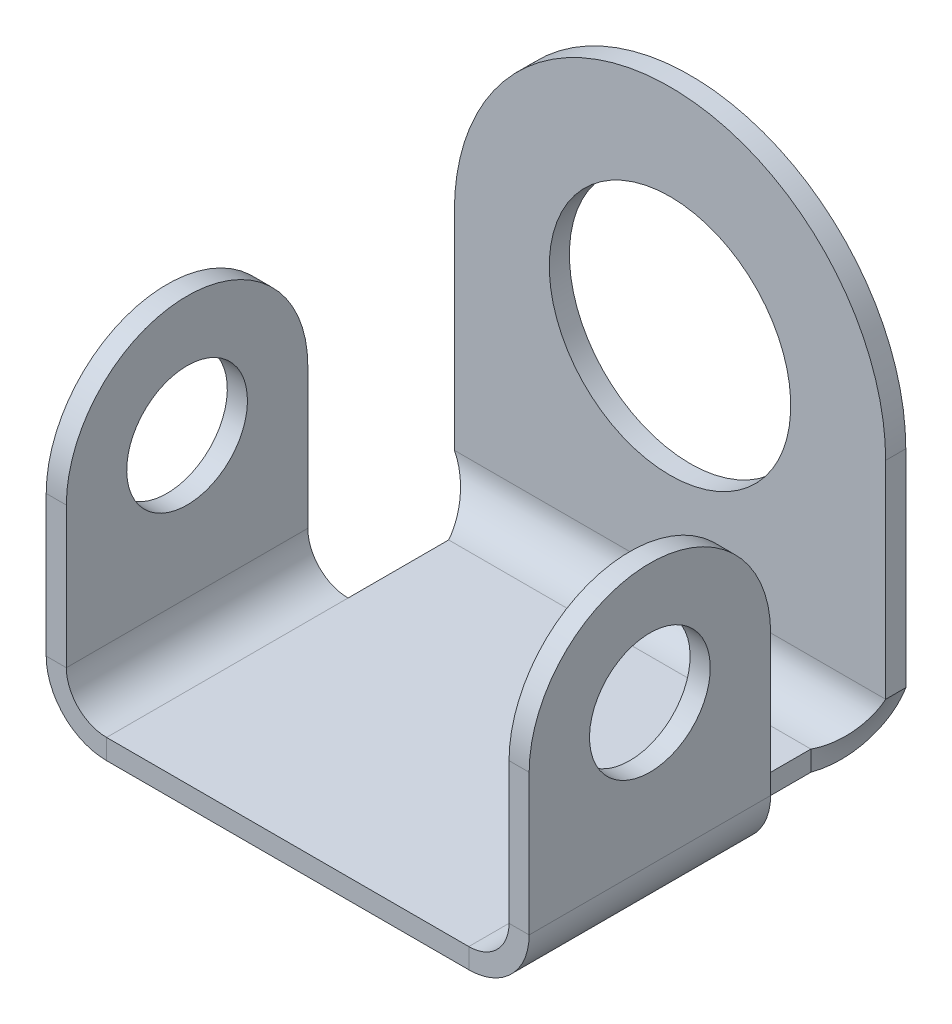
ISO-10303-21;
HEADER;
FILE_DESCRIPTION(('STEP AP214'),'2;1');
FILE_NAME('part.step','',(''),(''),'','','');
FILE_SCHEMA(('AUTOMOTIVE_DESIGN { 1 0 10303 214 1 1 1 1 }'));
ENDSEC;
DATA;
#1=APPLICATION_CONTEXT('core data for automotive mechanical design processes');
#2=APPLICATION_PROTOCOL_DEFINITION('international standard','automotive_design',2000,#1);
#3=PRODUCT_CONTEXT('',#1,'mechanical');
#4=PRODUCT('Part','Part','',(#3));
#5=PRODUCT_RELATED_PRODUCT_CATEGORY('part','',(#4));
#6=PRODUCT_DEFINITION_FORMATION('','',#4);
#7=PRODUCT_DEFINITION_CONTEXT('part definition',#1,'design');
#8=PRODUCT_DEFINITION('design','',#6,#7);
#9=PRODUCT_DEFINITION_SHAPE('','',#8);
#10=(LENGTH_UNIT() NAMED_UNIT(*) SI_UNIT(.MILLI.,.METRE.));
#11=(NAMED_UNIT(*) PLANE_ANGLE_UNIT() SI_UNIT($,.RADIAN.));
#12=(NAMED_UNIT(*) SI_UNIT($,.STERADIAN.) SOLID_ANGLE_UNIT());
#13=UNCERTAINTY_MEASURE_WITH_UNIT(LENGTH_MEASURE(1.E-05),#10,'distance_accuracy_value','');
#14=(GEOMETRIC_REPRESENTATION_CONTEXT(3) GLOBAL_UNCERTAINTY_ASSIGNED_CONTEXT((#13)) GLOBAL_UNIT_ASSIGNED_CONTEXT((#10,
#11,#12)) REPRESENTATION_CONTEXT('',''));
#15=CARTESIAN_POINT('',(0.,0.,0.));
#16=DIRECTION('',(0.,0.,1.));
#17=DIRECTION('',(1.,0.,0.));
#18=AXIS2_PLACEMENT_3D('',#15,#16,#17);
#19=CARTESIAN_POINT('',(0.,-2.5,0.));
#20=DIRECTION('',(0.,-1.,0.));
#21=DIRECTION('',(0.,0.,-1.));
#22=AXIS2_PLACEMENT_3D('',#19,#20,#21);
#23=PLANE('',#22);
#24=DIRECTION('',(0.,0.,-1.));
#25=VECTOR('',#24,1.);
#26=CARTESIAN_POINT('',(-22.5,-2.5,25.));
#27=LINE('',#26,#25);
#28=CARTESIAN_POINT('',(-22.5,-2.5,25.));
#29=VERTEX_POINT('',#28);
#30=CARTESIAN_POINT('',(-22.5,-2.5,-5.));
#31=VERTEX_POINT('',#30);
#32=EDGE_CURVE('E875',#29,#31,#27,.T.);
#33=ORIENTED_EDGE('',*,*,#32,.T.);
#34=DIRECTION('',(0.,0.,-1.));
#35=VECTOR('',#34,1.);
#36=CARTESIAN_POINT('',(-22.5,-2.5,3.74999999999999));
#37=LINE('',#36,#35);
#38=CARTESIAN_POINT('',(-22.5,-2.50000000000005,-17.5));
#39=VERTEX_POINT('',#38);
#40=EDGE_CURVE('E812',#31,#39,#37,.T.);
#41=ORIENTED_EDGE('',*,*,#40,.T.);
#42=DIRECTION('',(1.,0.,0.));
#43=VECTOR('',#42,1.);
#44=CARTESIAN_POINT('',(-26.7928932188135,-2.50000000000005,-17.5));
#45=LINE('',#44,#43);
#46=CARTESIAN_POINT('',(22.5,-2.50000000000005,-17.5));
#47=VERTEX_POINT('',#46);
#48=EDGE_CURVE('E839',#39,#47,#45,.T.);
#49=ORIENTED_EDGE('',*,*,#48,.T.);
#50=DIRECTION('',(0.,0.,1.));
#51=VECTOR('',#50,1.);
#52=CARTESIAN_POINT('',(22.5,-2.5,-21.7928932188135));
#53=LINE('',#52,#51);
#54=CARTESIAN_POINT('',(22.5,-2.5,-5.));
#55=VERTEX_POINT('',#54);
#56=EDGE_CURVE('E828',#47,#55,#53,.T.);
#57=ORIENTED_EDGE('',*,*,#56,.T.);
#58=DIRECTION('',(0.,0.,1.));
#59=VECTOR('',#58,1.);
#60=CARTESIAN_POINT('',(22.5,-2.5,-21.7928932188135));
#61=LINE('',#60,#59);
#62=CARTESIAN_POINT('',(22.5,-2.5,25.));
#63=VERTEX_POINT('',#62);
#64=EDGE_CURVE('E859',#55,#63,#61,.T.);
#65=ORIENTED_EDGE('',*,*,#64,.T.);
#66=DIRECTION('',(1.,0.,0.));
#67=VECTOR('',#66,1.);
#68=CARTESIAN_POINT('',(-30.,-2.5,25.));
#69=LINE('',#68,#67);
#70=EDGE_CURVE('E822',#29,#63,#69,.T.);
#71=ORIENTED_EDGE('',*,*,#70,.F.);
#72=EDGE_LOOP('',(#33,#41,#49,#57,#65,#71));
#73=FACE_BOUND('',#72,.T.);
#74=ADVANCED_FACE('F376',(#73),#23,.T.);
#75=CARTESIAN_POINT('',(0.,0.,0.));
#76=DIRECTION('',(0.,-1.,0.));
#77=DIRECTION('',(0.,0.,-1.));
#78=AXIS2_PLACEMENT_3D('',#75,#76,#77);
#79=PLANE('',#78);
#80=DIRECTION('',(1.,0.,0.));
#81=VECTOR('',#80,1.);
#82=CARTESIAN_POINT('',(-26.7928932188135,0.,-17.5));
#83=LINE('',#82,#81);
#84=CARTESIAN_POINT('',(-22.5,0.,-17.5));
#85=VERTEX_POINT('',#84);
#86=CARTESIAN_POINT('',(22.5,0.,-17.5));
#87=VERTEX_POINT('',#86);
#88=EDGE_CURVE('E386',#85,#87,#83,.T.);
#89=ORIENTED_EDGE('',*,*,#88,.F.);
#90=DIRECTION('',(0.,0.,-1.));
#91=VECTOR('',#90,1.);
#92=CARTESIAN_POINT('',(-22.5,0.,25.));
#93=LINE('',#92,#91);
#94=CARTESIAN_POINT('',(-22.5,0.,-5.));
#95=VERTEX_POINT('',#94);
#96=EDGE_CURVE('E825',#95,#85,#93,.T.);
#97=ORIENTED_EDGE('',*,*,#96,.F.);
#98=DIRECTION('',(0.,0.,-1.));
#99=VECTOR('',#98,1.);
#100=CARTESIAN_POINT('',(-22.5,0.,25.));
#101=LINE('',#100,#99);
#102=CARTESIAN_POINT('',(-22.5,0.,25.));
#103=VERTEX_POINT('',#102);
#104=EDGE_CURVE('E867',#103,#95,#101,.T.);
#105=ORIENTED_EDGE('',*,*,#104,.F.);
#106=DIRECTION('',(1.,0.,0.));
#107=VECTOR('',#106,1.);
#108=CARTESIAN_POINT('',(-30.,0.,25.));
#109=LINE('',#108,#107);
#110=CARTESIAN_POINT('',(22.5,0.,25.));
#111=VERTEX_POINT('',#110);
#112=EDGE_CURVE('E402',#103,#111,#109,.T.);
#113=ORIENTED_EDGE('',*,*,#112,.T.);
#114=DIRECTION('',(0.,0.,1.));
#115=VECTOR('',#114,1.);
#116=CARTESIAN_POINT('',(22.5,0.,-21.7928932188135));
#117=LINE('',#116,#115);
#118=CARTESIAN_POINT('',(22.5,0.,-5.));
#119=VERTEX_POINT('',#118);
#120=EDGE_CURVE('E852',#119,#111,#117,.T.);
#121=ORIENTED_EDGE('',*,*,#120,.F.);
#122=DIRECTION('',(0.,0.,1.));
#123=VECTOR('',#122,1.);
#124=CARTESIAN_POINT('',(22.5,0.,-21.7928932188135));
#125=LINE('',#124,#123);
#126=EDGE_CURVE('E832',#87,#119,#125,.T.);
#127=ORIENTED_EDGE('',*,*,#126,.F.);
#128=EDGE_LOOP('',(#89,#97,#105,#113,#121,#127));
#129=FACE_BOUND('',#128,.T.);
#130=ADVANCED_FACE('F930',(#129),#79,.F.);
#131=CARTESIAN_POINT('',(-30.,-2.5,25.));
#132=DIRECTION('',(0.,0.,1.));
#133=DIRECTION('',(1.,0.,0.));
#134=AXIS2_PLACEMENT_3D('',#131,#132,#133);
#135=PLANE('',#134);
#136=ORIENTED_EDGE('',*,*,#112,.F.);
#137=DIRECTION('',(0.,-1.,0.));
#138=VECTOR('',#137,1.);
#139=CARTESIAN_POINT('',(-22.5,0.,25.));
#140=LINE('',#139,#138);
#141=EDGE_CURVE('E871',#103,#29,#140,.T.);
#142=ORIENTED_EDGE('',*,*,#141,.T.);
#143=ORIENTED_EDGE('',*,*,#70,.T.);
#144=DIRECTION('',(0.,-1.,0.));
#145=VECTOR('',#144,1.);
#146=CARTESIAN_POINT('',(22.5,0.,25.));
#147=LINE('',#146,#145);
#148=EDGE_CURVE('E843',#111,#63,#147,.T.);
#149=ORIENTED_EDGE('',*,*,#148,.F.);
#150=EDGE_LOOP('',(#136,#142,#143,#149));
#151=FACE_BOUND('',#150,.T.);
#152=ADVANCED_FACE('F378',(#151),#135,.T.);
#153=CARTESIAN_POINT('',(22.5,-2.50627500000005,0.));
#154=DIRECTION('',(1.,0.,0.));
#155=DIRECTION('',(0.,0.,-1.));
#156=AXIS2_PLACEMENT_3D('',#153,#154,#155);
#157=PLANE('',#156);
#158=CARTESIAN_POINT('',(22.5,0.,-17.5));
#159=CARTESIAN_POINT('',(22.5,-2.50000000000005,-17.5));
#160=B_SPLINE_CURVE_WITH_KNOTS('',1,(#158,#159),.UNSPECIFIED.,.F.,.F.,(2,2),(0.,1.),.UNSPECIFIED.);
#161=EDGE_CURVE('E13',#47,#87,#160,.F.);
#162=ORIENTED_EDGE('',*,*,#161,.T.);
#163=ORIENTED_EDGE('',*,*,#126,.T.);
#164=DIRECTION('',(0.,1.,0.));
#165=VECTOR('',#164,1.);
#166=CARTESIAN_POINT('',(22.5,-2.50627500000005,-5.));
#167=LINE('',#166,#165);
#168=EDGE_CURVE('E855',#55,#119,#167,.T.);
#169=ORIENTED_EDGE('',*,*,#168,.F.);
#170=ORIENTED_EDGE('',*,*,#56,.F.);
#171=EDGE_LOOP('',(#162,#163,#169,#170));
#172=FACE_BOUND('',#171,.T.);
#173=ADVANCED_FACE('F937',(#172),#157,.T.);
#174=CARTESIAN_POINT('',(-22.5,-2.50627500000005,0.));
#175=DIRECTION('',(-1.,0.,0.));
#176=DIRECTION('',(0.,0.,1.));
#177=AXIS2_PLACEMENT_3D('',#174,#175,#176);
#178=PLANE('',#177);
#179=DIRECTION('',(0.,1.,0.));
#180=VECTOR('',#179,1.);
#181=CARTESIAN_POINT('',(-22.5,-2.50627500000005,-5.));
#182=LINE('',#181,#180);
#183=EDGE_CURVE('E863',#31,#95,#182,.T.);
#184=ORIENTED_EDGE('',*,*,#183,.T.);
#185=ORIENTED_EDGE('',*,*,#96,.T.);
#186=CARTESIAN_POINT('',(-22.5,-2.50000000000005,-17.5));
#187=CARTESIAN_POINT('',(-22.5,0.,-17.5));
#188=B_SPLINE_CURVE_WITH_KNOTS('',1,(#186,#187),.UNSPECIFIED.,.F.,.F.,(2,2),(0.,1.),.UNSPECIFIED.);
#189=EDGE_CURVE('E674',#39,#85,#188,.T.);
#190=ORIENTED_EDGE('',*,*,#189,.F.);
#191=ORIENTED_EDGE('',*,*,#40,.F.);
#192=EDGE_LOOP('',(#184,#185,#190,#191));
#193=FACE_BOUND('',#192,.T.);
#194=ADVANCED_FACE('F941',(#193),#178,.T.);
#195=CARTESIAN_POINT('',(-22.5,5.,-5.));
#196=DIRECTION('',(0.,0.,-1.));
#197=DIRECTION('',(0.,1.,0.));
#198=AXIS2_PLACEMENT_3D('',#195,#196,#197);
#199=PLANE('',#198);
#200=DIRECTION('',(1.,0.,0.));
#201=VECTOR('',#200,1.);
#202=CARTESIAN_POINT('',(-30.,5.00000000000002,-5.));
#203=LINE('',#202,#201);
#204=CARTESIAN_POINT('',(-30.,5.00000000000002,-5.));
#205=VERTEX_POINT('',#204);
#206=CARTESIAN_POINT('',(-27.5,5.00000000000004,-5.));
#207=VERTEX_POINT('',#206);
#208=EDGE_CURVE('E796',#205,#207,#203,.T.);
#209=ORIENTED_EDGE('',*,*,#208,.T.);
#210=CARTESIAN_POINT('',(-22.5,5.,-5.));
#211=DIRECTION('',(0.,0.,-1.));
#212=DIRECTION('',(0.,1.,0.));
#213=AXIS2_PLACEMENT_3D('',#210,#211,#212);
#214=CIRCLE('',#213,5.);
#215=EDGE_CURVE('E754',#207,#95,#214,.F.);
#216=ORIENTED_EDGE('',*,*,#215,.T.);
#217=ORIENTED_EDGE('',*,*,#183,.F.);
#218=CARTESIAN_POINT('',(-22.5,5.,-5.));
#219=DIRECTION('',(0.,0.,1.));
#220=DIRECTION('',(0.,1.,0.));
#221=AXIS2_PLACEMENT_3D('',#218,#219,#220);
#222=CIRCLE('',#221,7.5);
#223=EDGE_CURVE('E803',#205,#31,#222,.T.);
#224=ORIENTED_EDGE('',*,*,#223,.F.);
#225=EDGE_LOOP('',(#209,#216,#217,#224));
#226=FACE_BOUND('',#225,.T.);
#227=ADVANCED_FACE('F1153',(#226),#199,.T.);
#228=CARTESIAN_POINT('',(-22.5,5.,25.));
#229=DIRECTION('',(0.,0.,1.));
#230=DIRECTION('',(1.,0.,0.));
#231=AXIS2_PLACEMENT_3D('',#228,#229,#230);
#232=PLANE('',#231);
#233=ORIENTED_EDGE('',*,*,#141,.F.);
#234=CARTESIAN_POINT('',(-22.5,5.,25.));
#235=DIRECTION('',(0.,0.,-1.));
#236=DIRECTION('',(0.,1.,0.));
#237=AXIS2_PLACEMENT_3D('',#234,#235,#236);
#238=CIRCLE('',#237,5.);
#239=CARTESIAN_POINT('',(-27.5,5.00000000000004,25.));
#240=VERTEX_POINT('',#239);
#241=EDGE_CURVE('E808',#103,#240,#238,.T.);
#242=ORIENTED_EDGE('',*,*,#241,.T.);
#243=DIRECTION('',(-1.,0.,0.));
#244=VECTOR('',#243,1.);
#245=CARTESIAN_POINT('',(-27.5,5.00000000000003,25.));
#246=LINE('',#245,#244);
#247=CARTESIAN_POINT('',(-30.,5.,25.));
#248=VERTEX_POINT('',#247);
#249=EDGE_CURVE('E788',#240,#248,#246,.T.);
#250=ORIENTED_EDGE('',*,*,#249,.T.);
#251=CARTESIAN_POINT('',(-22.5,5.,25.));
#252=DIRECTION('',(0.,0.,-1.));
#253=DIRECTION('',(-1.,0.,0.));
#254=AXIS2_PLACEMENT_3D('',#251,#252,#253);
#255=CIRCLE('',#254,7.5);
#256=EDGE_CURVE('E807',#29,#248,#255,.T.);
#257=ORIENTED_EDGE('',*,*,#256,.F.);
#258=EDGE_LOOP('',(#233,#242,#250,#257));
#259=FACE_BOUND('',#258,.T.);
#260=ADVANCED_FACE('F1145',(#259),#232,.T.);
#261=CARTESIAN_POINT('',(-22.5,5.,41.6643783371692));
#262=DIRECTION('',(0.,0.,-1.));
#263=DIRECTION('',(0.,1.,0.));
#264=AXIS2_PLACEMENT_3D('',#261,#262,#263);
#265=CYLINDRICAL_SURFACE('',#264,7.5);
#266=ORIENTED_EDGE('',*,*,#256,.T.);
#267=DIRECTION('',(0.,0.,-1.));
#268=VECTOR('',#267,1.);
#269=CARTESIAN_POINT('',(-30.,5.00000000000002,-25.));
#270=LINE('',#269,#268);
#271=EDGE_CURVE('E744',#248,#205,#270,.T.);
#272=ORIENTED_EDGE('',*,*,#271,.T.);
#273=ORIENTED_EDGE('',*,*,#223,.T.);
#274=ORIENTED_EDGE('',*,*,#32,.F.);
#275=EDGE_LOOP('',(#266,#272,#273,#274));
#276=FACE_BOUND('',#275,.T.);
#277=ADVANCED_FACE('F1137',(#276),#265,.T.);
#278=CARTESIAN_POINT('',(-22.5,5.,41.6643783371692));
#279=DIRECTION('',(0.,0.,-1.));
#280=DIRECTION('',(0.,1.,0.));
#281=AXIS2_PLACEMENT_3D('',#278,#279,#280);
#282=CYLINDRICAL_SURFACE('',#281,5.);
#283=ORIENTED_EDGE('',*,*,#241,.F.);
#284=ORIENTED_EDGE('',*,*,#104,.T.);
#285=ORIENTED_EDGE('',*,*,#215,.F.);
#286=DIRECTION('',(0.,0.,1.));
#287=VECTOR('',#286,1.);
#288=CARTESIAN_POINT('',(-27.5,5.00000000000004,-25.));
#289=LINE('',#288,#287);
#290=EDGE_CURVE('E792',#207,#240,#289,.T.);
#291=ORIENTED_EDGE('',*,*,#290,.T.);
#292=EDGE_LOOP('',(#283,#284,#285,#291));
#293=FACE_BOUND('',#292,.T.);
#294=ADVANCED_FACE('F1129',(#293),#282,.F.);
#295=CARTESIAN_POINT('',(-30.006275,22.5000000000001,10.));
#296=DIRECTION('',(1.,0.,0.));
#297=DIRECTION('',(0.,0.,1.));
#298=AXIS2_PLACEMENT_3D('',#295,#296,#297);
#299=CYLINDRICAL_SURFACE('',#298,15.);
#300=DIRECTION('',(1.,0.,0.));
#301=VECTOR('',#300,1.);
#302=CARTESIAN_POINT('',(-30.006275,22.5000000000001,25.));
#303=LINE('',#302,#301);
#304=CARTESIAN_POINT('',(-30.0000000000001,22.5000000000001,25.));
#305=VERTEX_POINT('',#304);
#306=CARTESIAN_POINT('',(-27.5000000000001,22.5000000000001,25.));
#307=VERTEX_POINT('',#306);
#308=EDGE_CURVE('E785',#305,#307,#303,.T.);
#309=ORIENTED_EDGE('',*,*,#308,.T.);
#310=CARTESIAN_POINT('',(-27.5000000000001,22.5000000000001,10.));
#311=DIRECTION('',(1.,0.,0.));
#312=DIRECTION('',(0.,1.,0.));
#313=AXIS2_PLACEMENT_3D('',#310,#311,#312);
#314=CIRCLE('',#313,15.);
#315=CARTESIAN_POINT('',(-27.5000000000002,22.5000000000001,-4.99999999999999));
#316=VERTEX_POINT('',#315);
#317=EDGE_CURVE('E782',#307,#316,#314,.F.);
#318=ORIENTED_EDGE('',*,*,#317,.T.);
#319=DIRECTION('',(1.,0.,0.));
#320=VECTOR('',#319,1.);
#321=CARTESIAN_POINT('',(-30.006275,22.5000000000001,-4.99999999999999));
#322=LINE('',#321,#320);
#323=CARTESIAN_POINT('',(-30.0000000000002,22.5000000000001,-4.99999999999999));
#324=VERTEX_POINT('',#323);
#325=EDGE_CURVE('E755',#324,#316,#322,.T.);
#326=ORIENTED_EDGE('',*,*,#325,.F.);
#327=CARTESIAN_POINT('',(-30.0000000000001,22.5000000000001,10.));
#328=DIRECTION('',(1.,0.,0.));
#329=DIRECTION('',(0.,1.,0.));
#330=AXIS2_PLACEMENT_3D('',#327,#328,#329);
#331=CIRCLE('',#330,15.);
#332=EDGE_CURVE('E774',#305,#324,#331,.F.);
#333=ORIENTED_EDGE('',*,*,#332,.F.);
#334=EDGE_LOOP('',(#309,#318,#326,#333));
#335=FACE_BOUND('',#334,.T.);
#336=ADVANCED_FACE('F1121',(#335),#299,.T.);
#337=CARTESIAN_POINT('',(-30.006275,22.5000000000001,10.));
#338=DIRECTION('',(1.,0.,0.));
#339=DIRECTION('',(0.,0.,1.));
#340=AXIS2_PLACEMENT_3D('',#337,#338,#339);
#341=CYLINDRICAL_SURFACE('',#340,7.5);
#342=CARTESIAN_POINT('',(-27.5000000000001,22.5000000000001,10.));
#343=DIRECTION('',(1.,0.,0.));
#344=DIRECTION('',(0.,1.,0.));
#345=AXIS2_PLACEMENT_3D('',#342,#343,#344);
#346=CIRCLE('',#345,7.5);
#347=CARTESIAN_POINT('',(-27.5000000000001,30.0000000000001,10.));
#348=VERTEX_POINT('',#347);
#349=EDGE_CURVE('E759',#348,#348,#346,.F.);
#350=ORIENTED_EDGE('',*,*,#349,.F.);
#351=EDGE_LOOP('',(#350));
#352=FACE_BOUND('',#351,.T.);
#353=CARTESIAN_POINT('',(-30.0000000000001,22.5000000000001,10.));
#354=DIRECTION('',(1.,0.,0.));
#355=DIRECTION('',(0.,1.,0.));
#356=AXIS2_PLACEMENT_3D('',#353,#354,#355);
#357=CIRCLE('',#356,7.5);
#358=CARTESIAN_POINT('',(-30.0000000000001,30.0000000000001,10.));
#359=VERTEX_POINT('',#358);
#360=EDGE_CURVE('E778',#359,#359,#357,.F.);
#361=ORIENTED_EDGE('',*,*,#360,.T.);
#362=EDGE_LOOP('',(#361));
#363=FACE_BOUND('',#362,.T.);
#364=ADVANCED_FACE('F1113',(#352,#363),#341,.F.);
#365=CARTESIAN_POINT('',(-30.,0.,0.));
#366=DIRECTION('',(1.,0.,0.));
#367=DIRECTION('',(0.,1.,0.));
#368=AXIS2_PLACEMENT_3D('',#365,#366,#367);
#369=PLANE('',#368);
#370=ORIENTED_EDGE('',*,*,#360,.F.);
#371=EDGE_LOOP('',(#370));
#372=FACE_BOUND('',#371,.T.);
#373=ORIENTED_EDGE('',*,*,#332,.T.);
#374=DIRECTION('',(0.,-1.,0.));
#375=VECTOR('',#374,1.);
#376=CARTESIAN_POINT('',(-30.,0.,-5.));
#377=LINE('',#376,#375);
#378=EDGE_CURVE('E771',#324,#205,#377,.T.);
#379=ORIENTED_EDGE('',*,*,#378,.T.);
#380=ORIENTED_EDGE('',*,*,#271,.F.);
#381=DIRECTION('',(0.,1.,0.));
#382=VECTOR('',#381,1.);
#383=CARTESIAN_POINT('',(-30.,0.,25.));
#384=LINE('',#383,#382);
#385=EDGE_CURVE('E767',#248,#305,#384,.T.);
#386=ORIENTED_EDGE('',*,*,#385,.T.);
#387=EDGE_LOOP('',(#373,#379,#380,#386));
#388=FACE_BOUND('',#387,.T.);
#389=ADVANCED_FACE('F1105',(#372,#388),#369,.F.);
#390=CARTESIAN_POINT('',(-30.0000000000002,57.5,25.));
#391=DIRECTION('',(0.,0.,-1.));
#392=DIRECTION('',(-1.,0.,0.));
#393=AXIS2_PLACEMENT_3D('',#390,#391,#392);
#394=PLANE('',#393);
#395=DIRECTION('',(0.,-1.,0.));
#396=VECTOR('',#395,1.);
#397=CARTESIAN_POINT('',(-27.5000000000002,57.5,25.));
#398=LINE('',#397,#396);
#399=EDGE_CURVE('E763',#240,#307,#398,.F.);
#400=ORIENTED_EDGE('',*,*,#399,.T.);
#401=ORIENTED_EDGE('',*,*,#308,.F.);
#402=ORIENTED_EDGE('',*,*,#385,.F.);
#403=ORIENTED_EDGE('',*,*,#249,.F.);
#404=EDGE_LOOP('',(#400,#401,#402,#403));
#405=FACE_BOUND('',#404,.T.);
#406=ADVANCED_FACE('F1097',(#405),#394,.F.);
#407=CARTESIAN_POINT('',(-27.5,0.,0.));
#408=DIRECTION('',(1.,0.,0.));
#409=DIRECTION('',(0.,1.,0.));
#410=AXIS2_PLACEMENT_3D('',#407,#408,#409);
#411=PLANE('',#410);
#412=ORIENTED_EDGE('',*,*,#349,.T.);
#413=EDGE_LOOP('',(#412));
#414=FACE_BOUND('',#413,.T.);
#415=DIRECTION('',(0.,-1.,0.));
#416=VECTOR('',#415,1.);
#417=CARTESIAN_POINT('',(-27.5,0.,-5.));
#418=LINE('',#417,#416);
#419=EDGE_CURVE('E751',#316,#207,#418,.T.);
#420=ORIENTED_EDGE('',*,*,#419,.F.);
#421=ORIENTED_EDGE('',*,*,#317,.F.);
#422=ORIENTED_EDGE('',*,*,#399,.F.);
#423=ORIENTED_EDGE('',*,*,#290,.F.);
#424=EDGE_LOOP('',(#420,#421,#422,#423));
#425=FACE_BOUND('',#424,.T.);
#426=ADVANCED_FACE('F1089',(#414,#425),#411,.T.);
#427=CARTESIAN_POINT('',(-30.0062750000002,-27.3174770424681,-5.));
#428=DIRECTION('',(0.,0.,1.));
#429=DIRECTION('',(0.,-1.,0.));
#430=AXIS2_PLACEMENT_3D('',#427,#428,#429);
#431=PLANE('',#430);
#432=ORIENTED_EDGE('',*,*,#208,.F.);
#433=ORIENTED_EDGE('',*,*,#378,.F.);
#434=ORIENTED_EDGE('',*,*,#325,.T.);
#435=ORIENTED_EDGE('',*,*,#419,.T.);
#436=EDGE_LOOP('',(#432,#433,#434,#435));
#437=FACE_BOUND('',#436,.T.);
#438=ADVANCED_FACE('F1081',(#437),#431,.F.);
#439=CARTESIAN_POINT('',(22.5,5.,-5.));
#440=DIRECTION('',(0.,0.,-1.));
#441=DIRECTION('',(-1.,0.,0.));
#442=AXIS2_PLACEMENT_3D('',#439,#440,#441);
#443=PLANE('',#442);
#444=ORIENTED_EDGE('',*,*,#168,.T.);
#445=CARTESIAN_POINT('',(22.5,5.,-5.));
#446=DIRECTION('',(0.,0.,1.));
#447=DIRECTION('',(1.,0.,0.));
#448=AXIS2_PLACEMENT_3D('',#445,#446,#447);
#449=CIRCLE('',#448,5.);
#450=CARTESIAN_POINT('',(27.5,5.00000000000008,-5.));
#451=VERTEX_POINT('',#450);
#452=EDGE_CURVE('E686',#119,#451,#449,.T.);
#453=ORIENTED_EDGE('',*,*,#452,.T.);
#454=DIRECTION('',(1.,0.,0.));
#455=VECTOR('',#454,1.);
#456=CARTESIAN_POINT('',(27.5,5.00000000000008,-5.));
#457=LINE('',#456,#455);
#458=CARTESIAN_POINT('',(30.,5.00000000000007,-5.));
#459=VERTEX_POINT('',#458);
#460=EDGE_CURVE('E723',#451,#459,#457,.T.);
#461=ORIENTED_EDGE('',*,*,#460,.T.);
#462=CARTESIAN_POINT('',(22.5,5.,-5.));
#463=DIRECTION('',(0.,0.,1.));
#464=DIRECTION('',(1.,0.,0.));
#465=AXIS2_PLACEMENT_3D('',#462,#463,#464);
#466=CIRCLE('',#465,7.5);
#467=EDGE_CURVE('E735',#55,#459,#466,.T.);
#468=ORIENTED_EDGE('',*,*,#467,.F.);
#469=EDGE_LOOP('',(#444,#453,#461,#468));
#470=FACE_BOUND('',#469,.T.);
#471=ADVANCED_FACE('F1073',(#470),#443,.T.);
#472=CARTESIAN_POINT('',(22.5,5.,25.));
#473=DIRECTION('',(0.,0.,1.));
#474=DIRECTION('',(1.,0.,0.));
#475=AXIS2_PLACEMENT_3D('',#472,#473,#474);
#476=PLANE('',#475);
#477=CARTESIAN_POINT('',(22.5,5.,25.));
#478=DIRECTION('',(0.,0.,1.));
#479=DIRECTION('',(1.,0.,0.));
#480=AXIS2_PLACEMENT_3D('',#477,#478,#479);
#481=CIRCLE('',#480,5.);
#482=CARTESIAN_POINT('',(27.5,5.00000000000008,25.));
#483=VERTEX_POINT('',#482);
#484=EDGE_CURVE('E740',#483,#111,#481,.F.);
#485=ORIENTED_EDGE('',*,*,#484,.T.);
#486=ORIENTED_EDGE('',*,*,#148,.T.);
#487=CARTESIAN_POINT('',(22.5,5.,25.));
#488=DIRECTION('',(0.,0.,-1.));
#489=DIRECTION('',(-1.,0.,0.));
#490=AXIS2_PLACEMENT_3D('',#487,#488,#489);
#491=CIRCLE('',#490,7.5);
#492=CARTESIAN_POINT('',(30.,4.99999999999997,25.));
#493=VERTEX_POINT('',#492);
#494=EDGE_CURVE('E739',#493,#63,#491,.T.);
#495=ORIENTED_EDGE('',*,*,#494,.F.);
#496=DIRECTION('',(1.,0.,0.));
#497=VECTOR('',#496,1.);
#498=CARTESIAN_POINT('',(30.,5.00000000000007,25.));
#499=LINE('',#498,#497);
#500=EDGE_CURVE('E678',#483,#493,#499,.T.);
#501=ORIENTED_EDGE('',*,*,#500,.F.);
#502=EDGE_LOOP('',(#485,#486,#495,#501));
#503=FACE_BOUND('',#502,.T.);
#504=ADVANCED_FACE('F1065',(#503),#476,.T.);
#505=CARTESIAN_POINT('',(22.5,5.,-21.6643783371692));
#506=DIRECTION('',(0.,0.,1.));
#507=DIRECTION('',(1.,0.,0.));
#508=AXIS2_PLACEMENT_3D('',#505,#506,#507);
#509=CYLINDRICAL_SURFACE('',#508,7.5);
#510=DIRECTION('',(0.,0.,1.));
#511=VECTOR('',#510,1.);
#512=CARTESIAN_POINT('',(30.,5.00000000000007,25.));
#513=LINE('',#512,#511);
#514=EDGE_CURVE('E731',#459,#493,#513,.T.);
#515=ORIENTED_EDGE('',*,*,#514,.T.);
#516=ORIENTED_EDGE('',*,*,#494,.T.);
#517=ORIENTED_EDGE('',*,*,#64,.F.);
#518=ORIENTED_EDGE('',*,*,#467,.T.);
#519=EDGE_LOOP('',(#515,#516,#517,#518));
#520=FACE_BOUND('',#519,.T.);
#521=ADVANCED_FACE('F1057',(#520),#509,.T.);
#522=CARTESIAN_POINT('',(22.5,5.,-21.6643783371692));
#523=DIRECTION('',(0.,0.,1.));
#524=DIRECTION('',(1.,0.,0.));
#525=AXIS2_PLACEMENT_3D('',#522,#523,#524);
#526=CYLINDRICAL_SURFACE('',#525,5.);
#527=DIRECTION('',(0.,0.,-1.));
#528=VECTOR('',#527,1.);
#529=CARTESIAN_POINT('',(27.5,5.00000000000008,25.));
#530=LINE('',#529,#528);
#531=EDGE_CURVE('E727',#483,#451,#530,.T.);
#532=ORIENTED_EDGE('',*,*,#531,.T.);
#533=ORIENTED_EDGE('',*,*,#452,.F.);
#534=ORIENTED_EDGE('',*,*,#120,.T.);
#535=ORIENTED_EDGE('',*,*,#484,.F.);
#536=EDGE_LOOP('',(#532,#533,#534,#535));
#537=FACE_BOUND('',#536,.T.);
#538=ADVANCED_FACE('F1050',(#537),#526,.F.);
#539=CARTESIAN_POINT('',(30.006275,22.5000000000001,9.99999999999999));
#540=DIRECTION('',(-1.,0.,0.));
#541=DIRECTION('',(0.,0.,1.));
#542=AXIS2_PLACEMENT_3D('',#539,#540,#541);
#543=CYLINDRICAL_SURFACE('',#542,15.);
#544=CARTESIAN_POINT('',(30.,22.5000000000001,9.99999999999999));
#545=DIRECTION('',(-1.,0.,0.));
#546=DIRECTION('',(0.,-1.,0.));
#547=AXIS2_PLACEMENT_3D('',#544,#545,#546);
#548=CIRCLE('',#547,15.);
#549=CARTESIAN_POINT('',(30.0000000000003,22.5000000000001,25.));
#550=VERTEX_POINT('',#549);
#551=CARTESIAN_POINT('',(30.,22.5000000000001,-5.));
#552=VERTEX_POINT('',#551);
#553=EDGE_CURVE('E720',#550,#552,#548,.T.);
#554=ORIENTED_EDGE('',*,*,#553,.T.);
#555=DIRECTION('',(-1.,0.,0.));
#556=VECTOR('',#555,1.);
#557=CARTESIAN_POINT('',(30.006275,22.5000000000001,-5.));
#558=LINE('',#557,#556);
#559=CARTESIAN_POINT('',(27.5,22.5000000000001,-5.));
#560=VERTEX_POINT('',#559);
#561=EDGE_CURVE('E716',#552,#560,#558,.T.);
#562=ORIENTED_EDGE('',*,*,#561,.T.);
#563=CARTESIAN_POINT('',(27.5,22.5000000000001,9.99999999999999));
#564=DIRECTION('',(-1.,0.,0.));
#565=DIRECTION('',(0.,-1.,0.));
#566=AXIS2_PLACEMENT_3D('',#563,#564,#565);
#567=CIRCLE('',#566,15.);
#568=CARTESIAN_POINT('',(27.5,22.5000000000001,25.));
#569=VERTEX_POINT('',#568);
#570=EDGE_CURVE('E697',#569,#560,#567,.T.);
#571=ORIENTED_EDGE('',*,*,#570,.F.);
#572=DIRECTION('',(-1.,0.,0.));
#573=VECTOR('',#572,1.);
#574=CARTESIAN_POINT('',(29.9999999999999,22.5000000000001,25.));
#575=LINE('',#574,#573);
#576=EDGE_CURVE('E690',#550,#569,#575,.T.);
#577=ORIENTED_EDGE('',*,*,#576,.F.);
#578=EDGE_LOOP('',(#554,#562,#571,#577));
#579=FACE_BOUND('',#578,.T.);
#580=ADVANCED_FACE('F648',(#579),#543,.T.);
#581=CARTESIAN_POINT('',(30.006275,22.5000000000001,9.99999999999999));
#582=DIRECTION('',(-1.,0.,0.));
#583=DIRECTION('',(0.,0.,1.));
#584=AXIS2_PLACEMENT_3D('',#581,#582,#583);
#585=CYLINDRICAL_SURFACE('',#584,7.5);
#586=CARTESIAN_POINT('',(27.5,22.5000000000001,9.99999999999999));
#587=DIRECTION('',(-1.,0.,0.));
#588=DIRECTION('',(0.,-1.,0.));
#589=AXIS2_PLACEMENT_3D('',#586,#587,#588);
#590=CIRCLE('',#589,7.5);
#591=CARTESIAN_POINT('',(27.5,15.0000000000001,9.99999999999999));
#592=VERTEX_POINT('',#591);
#593=EDGE_CURVE('E712',#592,#592,#590,.T.);
#594=ORIENTED_EDGE('',*,*,#593,.T.);
#595=EDGE_LOOP('',(#594));
#596=FACE_BOUND('',#595,.T.);
#597=CARTESIAN_POINT('',(30.,22.5000000000001,9.99999999999999));
#598=DIRECTION('',(-1.,0.,0.));
#599=DIRECTION('',(0.,-1.,0.));
#600=AXIS2_PLACEMENT_3D('',#597,#598,#599);
#601=CIRCLE('',#600,7.5);
#602=CARTESIAN_POINT('',(30.,15.0000000000001,9.99999999999999));
#603=VERTEX_POINT('',#602);
#604=EDGE_CURVE('E708',#603,#603,#601,.T.);
#605=ORIENTED_EDGE('',*,*,#604,.F.);
#606=EDGE_LOOP('',(#605));
#607=FACE_BOUND('',#606,.T.);
#608=ADVANCED_FACE('F1036',(#596,#607),#585,.F.);
#609=CARTESIAN_POINT('',(30.,0.,0.));
#610=DIRECTION('',(-1.,0.,0.));
#611=DIRECTION('',(0.,-1.,0.));
#612=AXIS2_PLACEMENT_3D('',#609,#610,#611);
#613=PLANE('',#612);
#614=ORIENTED_EDGE('',*,*,#604,.T.);
#615=EDGE_LOOP('',(#614));
#616=FACE_BOUND('',#615,.T.);
#617=ORIENTED_EDGE('',*,*,#553,.F.);
#618=DIRECTION('',(0.,-1.,0.));
#619=VECTOR('',#618,1.);
#620=CARTESIAN_POINT('',(30.,0.,25.));
#621=LINE('',#620,#619);
#622=EDGE_CURVE('E704',#550,#493,#621,.T.);
#623=ORIENTED_EDGE('',*,*,#622,.T.);
#624=ORIENTED_EDGE('',*,*,#514,.F.);
#625=DIRECTION('',(0.,-1.,0.));
#626=VECTOR('',#625,1.);
#627=CARTESIAN_POINT('',(30.,0.,-5.));
#628=LINE('',#627,#626);
#629=EDGE_CURVE('E701',#552,#459,#628,.T.);
#630=ORIENTED_EDGE('',*,*,#629,.F.);
#631=EDGE_LOOP('',(#617,#623,#624,#630));
#632=FACE_BOUND('',#631,.T.);
#633=ADVANCED_FACE('F1028',(#616,#632),#613,.F.);
#634=CARTESIAN_POINT('',(30.0062750000002,-27.3174770424681,-5.));
#635=DIRECTION('',(0.,0.,-1.));
#636=DIRECTION('',(0.,-1.,0.));
#637=AXIS2_PLACEMENT_3D('',#634,#635,#636);
#638=PLANE('',#637);
#639=ORIENTED_EDGE('',*,*,#460,.F.);
#640=DIRECTION('',(0.,-1.,0.));
#641=VECTOR('',#640,1.);
#642=CARTESIAN_POINT('',(27.5,0.,-5.));
#643=LINE('',#642,#641);
#644=EDGE_CURVE('E694',#560,#451,#643,.T.);
#645=ORIENTED_EDGE('',*,*,#644,.F.);
#646=ORIENTED_EDGE('',*,*,#561,.F.);
#647=ORIENTED_EDGE('',*,*,#629,.T.);
#648=EDGE_LOOP('',(#639,#645,#646,#647));
#649=FACE_BOUND('',#648,.T.);
#650=ADVANCED_FACE('F1020',(#649),#638,.T.);
#651=CARTESIAN_POINT('',(27.5,0.,0.));
#652=DIRECTION('',(-1.,0.,0.));
#653=DIRECTION('',(0.,-1.,0.));
#654=AXIS2_PLACEMENT_3D('',#651,#652,#653);
#655=PLANE('',#654);
#656=ORIENTED_EDGE('',*,*,#593,.F.);
#657=EDGE_LOOP('',(#656));
#658=FACE_BOUND('',#657,.T.);
#659=DIRECTION('',(0.,1.,0.));
#660=VECTOR('',#659,1.);
#661=CARTESIAN_POINT('',(27.5,0.,25.));
#662=LINE('',#661,#660);
#663=EDGE_CURVE('E687',#569,#483,#662,.F.);
#664=ORIENTED_EDGE('',*,*,#663,.F.);
#665=ORIENTED_EDGE('',*,*,#570,.T.);
#666=ORIENTED_EDGE('',*,*,#644,.T.);
#667=ORIENTED_EDGE('',*,*,#531,.F.);
#668=EDGE_LOOP('',(#664,#665,#666,#667));
#669=FACE_BOUND('',#668,.T.);
#670=ADVANCED_FACE('F1012',(#658,#669),#655,.T.);
#671=CARTESIAN_POINT('',(30.,0.,25.));
#672=DIRECTION('',(0.,0.,-1.));
#673=DIRECTION('',(-1.,0.,0.));
#674=AXIS2_PLACEMENT_3D('',#671,#672,#673);
#675=PLANE('',#674);
#676=ORIENTED_EDGE('',*,*,#622,.F.);
#677=ORIENTED_EDGE('',*,*,#576,.T.);
#678=ORIENTED_EDGE('',*,*,#663,.T.);
#679=ORIENTED_EDGE('',*,*,#500,.T.);
#680=EDGE_LOOP('',(#676,#677,#678,#679));
#681=FACE_BOUND('',#680,.T.);
#682=ADVANCED_FACE('F1006',(#681),#675,.F.);
#683=CARTESIAN_POINT('',(26.7928932188135,4.99999999999995,-25.));
#684=CARTESIAN_POINT('',(26.4350951779852,4.01809603753167,-25.));
#685=CARTESIAN_POINT('',(26.0774110156779,3.03689086730534,-24.8047950750124));
#686=CARTESIAN_POINT('',(25.3619288125423,1.2228576472182,-24.053397912657));
#687=CARTESIAN_POINT('',(25.0041877109745,0.390899600188084,-23.4975013179864));
#688=CARTESIAN_POINT('',(24.288705507839,-0.997501317986405,-22.1091003998119));
#689=CARTESIAN_POINT('',(23.9309644062712,-1.55339791265699,-21.2771423527818));
#690=CARTESIAN_POINT('',(23.2154822031356,-2.30479507501242,-19.4631091326946));
#691=CARTESIAN_POINT('',(22.8577980408283,-2.50000000000005,-18.4819039624683));
#692=CARTESIAN_POINT('',(22.5,-2.50000000000005,-17.5));
#693=CARTESIAN_POINT('',(26.7928932188135,4.99999999999995,-22.5));
#694=CARTESIAN_POINT('',(26.4351024546319,4.34541067120592,-22.5));
#695=CARTESIAN_POINT('',(26.0774110156779,3.69126057820354,-22.3698633833416));
#696=CARTESIAN_POINT('',(25.3619288125423,2.48190509814545,-21.8689319417713));
#697=CARTESIAN_POINT('',(25.0041877109745,1.92726640012537,-21.4983342119909));
#698=CARTESIAN_POINT('',(24.288705507839,1.00166578800905,-20.5727335998746));
#699=CARTESIAN_POINT('',(23.9309644062712,0.631068058228659,-20.0180949018545));
#700=CARTESIAN_POINT('',(23.2154822031356,0.13013661665837,-18.8087394217964));
#701=CARTESIAN_POINT('',(22.8577907641816,0.,-18.154589328794));
#702=CARTESIAN_POINT('',(22.5,0.,-17.5));
#703=B_SPLINE_SURFACE_WITH_KNOTS('',1,3,((#683,#684,#685,#686,#687,#688,#689,#690,#691,#692),
(#693,#694,#695,#696,#697,#698,#699,#700,#701,#702)),.UNSPECIFIED.,.F.,.F.,.F.,(2,2),(4,2,2,2,
4),(0.,1.),(0.,0.25,0.5,0.75,1.),.UNSPECIFIED.);
#704=CARTESIAN_POINT('',(26.7928932188135,4.99999999999995,-25.));
#705=CARTESIAN_POINT('',(26.7928932188135,4.99999999999995,-22.5));
#706=B_SPLINE_CURVE_WITH_KNOTS('',1,(#704,#705),.UNSPECIFIED.,.F.,.F.,(2,2),(0.,1.),.UNSPECIFIED.);
#707=CARTESIAN_POINT('',(26.7928932188135,4.99999999999997,-25.));
#708=VERTEX_POINT('',#707);
#709=CARTESIAN_POINT('',(26.7928932188135,4.99999999999995,-22.5));
#710=VERTEX_POINT('',#709);
#711=EDGE_CURVE('E562',#708,#710,#706,.T.);
#712=CARTESIAN_POINT('',(26.7928932188135,4.99999999999995,-22.5));
#713=CARTESIAN_POINT('',(26.4351024546319,4.34541067120592,-22.5));
#714=CARTESIAN_POINT('',(26.0774110156779,3.69126057820354,-22.3698633833416));
#715=CARTESIAN_POINT('',(25.3619288125423,2.48190509814545,-21.8689319417713));
#716=CARTESIAN_POINT('',(25.0041877109745,1.92726640012537,-21.4983342119909));
#717=CARTESIAN_POINT('',(24.288705507839,1.00166578800905,-20.5727335998746));
#718=CARTESIAN_POINT('',(23.9309644062712,0.631068058228659,-20.0180949018545));
#719=CARTESIAN_POINT('',(23.2154822031356,0.13013661665837,-18.8087394217964));
#720=CARTESIAN_POINT('',(22.8577907641816,0.,-18.154589328794));
#721=CARTESIAN_POINT('',(22.5,0.,-17.5));
#722=B_SPLINE_CURVE_WITH_KNOTS('',3,(#712,#713,#714,#715,#716,#717,#718,#719,#720,#721),
.UNSPECIFIED.,.F.,.F.,(4,2,2,2,4),(0.,0.25,0.5,0.75,1.),.UNSPECIFIED.);
#723=EDGE_CURVE('E393',#710,#87,#722,.T.);
#724=CARTESIAN_POINT('',(22.5,-2.50000000000005,-17.5));
#725=CARTESIAN_POINT('',(22.8577980408283,-2.50000000000005,-18.4819039624683));
#726=CARTESIAN_POINT('',(23.2154822031356,-2.30479507501242,-19.4631091326946));
#727=CARTESIAN_POINT('',(23.9309644062712,-1.55339791265699,-21.2771423527818));
#728=CARTESIAN_POINT('',(24.288705507839,-0.997501317986405,-22.1091003998119));
#729=CARTESIAN_POINT('',(25.0041877109745,0.390899600188084,-23.4975013179864));
#730=CARTESIAN_POINT('',(25.3619288125423,1.2228576472182,-24.053397912657));
#731=CARTESIAN_POINT('',(26.0774110156779,3.03689086730534,-24.8047950750124));
#732=CARTESIAN_POINT('',(26.4350951779852,4.01809603753167,-25.));
#733=CARTESIAN_POINT('',(26.7928932188135,4.99999999999995,-25.));
#734=B_SPLINE_CURVE_WITH_KNOTS('',3,(#724,#725,#726,#727,#728,#729,#730,#731,#732,#733),
.UNSPECIFIED.,.F.,.F.,(4,2,2,2,4),(0.,0.25,0.5,0.75,1.),.UNSPECIFIED.);
#735=EDGE_CURVE('E884',#708,#47,#734,.F.);
#736=ORIENTED_EDGE('',*,*,#711,.T.);
#737=ORIENTED_EDGE('',*,*,#723,.T.);
#738=ORIENTED_EDGE('',*,*,#161,.F.);
#739=ORIENTED_EDGE('',*,*,#735,.F.);
#740=EDGE_LOOP('',(#736,#737,#738,#739));
#741=FACE_BOUND('',#740,.T.);
#742=ADVANCED_FACE('F644',(#741),#703,.T.);
#743=CARTESIAN_POINT('',(-22.5,-2.50000000000005,-17.5));
#744=CARTESIAN_POINT('',(-22.8577980408283,-2.50000000000005,-18.4819039624683));
#745=CARTESIAN_POINT('',(-23.2154822031356,-2.30479507501242,-19.4631091326946));
#746=CARTESIAN_POINT('',(-23.9309644062712,-1.55339791265699,-21.2771423527818));
#747=CARTESIAN_POINT('',(-24.288705507839,-0.997501317986405,-22.1091003998119));
#748=CARTESIAN_POINT('',(-25.0041877109745,0.390899600188084,-23.4975013179864));
#749=CARTESIAN_POINT('',(-25.3619288125423,1.2228576472182,-24.053397912657));
#750=CARTESIAN_POINT('',(-26.0774110156779,3.03689086730534,-24.8047950750124));
#751=CARTESIAN_POINT('',(-26.4350951779852,4.01809603753169,-25.));
#752=CARTESIAN_POINT('',(-26.7928932188135,4.99999999999995,-25.));
#753=CARTESIAN_POINT('',(-22.5,0.,-17.5));
#754=CARTESIAN_POINT('',(-22.8577907641816,0.,-18.154589328794));
#755=CARTESIAN_POINT('',(-23.2154822031356,0.13013661665837,-18.8087394217964));
#756=CARTESIAN_POINT('',(-23.9309644062712,0.631068058228659,-20.0180949018545));
#757=CARTESIAN_POINT('',(-24.288705507839,1.00166578800905,-20.5727335998746));
#758=CARTESIAN_POINT('',(-25.0041877109745,1.92726640012537,-21.4983342119909));
#759=CARTESIAN_POINT('',(-25.3619288125423,2.48190509814545,-21.8689319417713));
#760=CARTESIAN_POINT('',(-26.0774110156779,3.69126057820354,-22.3698633833416));
#761=CARTESIAN_POINT('',(-26.435102454632,4.34541067120592,-22.5));
#762=CARTESIAN_POINT('',(-26.7928932188135,4.99999999999995,-22.5));
#763=B_SPLINE_SURFACE_WITH_KNOTS('',1,3,((#743,#744,#745,#746,#747,#748,#749,#750,#751,#752),
(#753,#754,#755,#756,#757,#758,#759,#760,#761,#762)),.UNSPECIFIED.,.F.,.F.,.F.,(2,2),(4,2,2,2,
4),(0.,1.),(0.,0.25,0.5,0.75,1.),.UNSPECIFIED.);
#764=CARTESIAN_POINT('',(-22.5,0.,-17.5));
#765=CARTESIAN_POINT('',(-22.8577907641816,0.,-18.154589328794));
#766=CARTESIAN_POINT('',(-23.2154822031356,0.13013661665837,-18.8087394217964));
#767=CARTESIAN_POINT('',(-23.9309644062712,0.631068058228659,-20.0180949018545));
#768=CARTESIAN_POINT('',(-24.288705507839,1.00166578800905,-20.5727335998746));
#769=CARTESIAN_POINT('',(-25.0041877109745,1.92726640012537,-21.4983342119909));
#770=CARTESIAN_POINT('',(-25.3619288125423,2.48190509814545,-21.8689319417713));
#771=CARTESIAN_POINT('',(-26.0774110156779,3.69126057820354,-22.3698633833416));
#772=CARTESIAN_POINT('',(-26.435102454632,4.34541067120592,-22.5));
#773=CARTESIAN_POINT('',(-26.7928932188135,4.99999999999995,-22.5));
#774=B_SPLINE_CURVE_WITH_KNOTS('',3,(#764,#765,#766,#767,#768,#769,#770,#771,#772,#773),
.UNSPECIFIED.,.F.,.F.,(4,2,2,2,4),(0.,0.25,0.5,0.75,1.),.UNSPECIFIED.);
#775=CARTESIAN_POINT('',(-26.7928932188135,4.99999999999995,-22.5));
#776=VERTEX_POINT('',#775);
#777=EDGE_CURVE('E616',#85,#776,#774,.T.);
#778=CARTESIAN_POINT('',(-26.7928932188135,4.99999999999995,-22.5));
#779=CARTESIAN_POINT('',(-26.7928932188135,4.99999999999995,-25.));
#780=B_SPLINE_CURVE_WITH_KNOTS('',1,(#778,#779),.UNSPECIFIED.,.F.,.F.,(2,2),(0.,1.),.UNSPECIFIED.);
#781=CARTESIAN_POINT('',(-26.7928932188135,5.00000000000002,-25.));
#782=VERTEX_POINT('',#781);
#783=EDGE_CURVE('E532',#782,#776,#780,.F.);
#784=CARTESIAN_POINT('',(-26.7928932188135,4.99999999999995,-25.));
#785=CARTESIAN_POINT('',(-26.4350951779852,4.01809603753169,-25.));
#786=CARTESIAN_POINT('',(-26.0774110156779,3.03689086730534,-24.8047950750124));
#787=CARTESIAN_POINT('',(-25.3619288125423,1.2228576472182,-24.053397912657));
#788=CARTESIAN_POINT('',(-25.0041877109745,0.390899600188084,-23.4975013179864));
#789=CARTESIAN_POINT('',(-24.288705507839,-0.997501317986405,-22.1091003998119));
#790=CARTESIAN_POINT('',(-23.9309644062712,-1.55339791265699,-21.2771423527818));
#791=CARTESIAN_POINT('',(-23.2154822031356,-2.30479507501242,-19.4631091326946));
#792=CARTESIAN_POINT('',(-22.8577980408283,-2.50000000000005,-18.4819039624683));
#793=CARTESIAN_POINT('',(-22.5,-2.50000000000005,-17.5));
#794=B_SPLINE_CURVE_WITH_KNOTS('',3,(#784,#785,#786,#787,#788,#789,#790,#791,#792,#793),
.UNSPECIFIED.,.F.,.F.,(4,2,2,2,4),(0.,0.25,0.5,0.75,1.),.UNSPECIFIED.);
#795=EDGE_CURVE('E611',#39,#782,#794,.F.);
#796=ORIENTED_EDGE('',*,*,#777,.T.);
#797=ORIENTED_EDGE('',*,*,#783,.F.);
#798=ORIENTED_EDGE('',*,*,#795,.F.);
#799=ORIENTED_EDGE('',*,*,#189,.T.);
#800=EDGE_LOOP('',(#796,#797,#798,#799));
#801=FACE_BOUND('',#800,.T.);
#802=ADVANCED_FACE('F588',(#801),#763,.T.);
#803=CARTESIAN_POINT('',(-54.5350287761761,4.99999999999995,-17.5));
#804=DIRECTION('',(1.,0.,0.));
#805=DIRECTION('',(0.,0.,-1.));
#806=AXIS2_PLACEMENT_3D('',#803,#804,#805);
#807=CYLINDRICAL_SURFACE('',#806,7.5);
#808=ORIENTED_EDGE('',*,*,#48,.F.);
#809=ORIENTED_EDGE('',*,*,#795,.T.);
#810=DIRECTION('',(1.,0.,0.));
#811=VECTOR('',#810,1.);
#812=CARTESIAN_POINT('',(30.,5.00000000000002,-25.));
#813=LINE('',#812,#811);
#814=EDGE_CURVE('E565',#782,#708,#813,.T.);
#815=ORIENTED_EDGE('',*,*,#814,.T.);
#816=ORIENTED_EDGE('',*,*,#735,.T.);
#817=EDGE_LOOP('',(#808,#809,#815,#816));
#818=FACE_BOUND('',#817,.T.);
#819=ADVANCED_FACE('F577',(#818),#807,.T.);
#820=CARTESIAN_POINT('',(-54.5350287761761,4.99999999999995,-17.5));
#821=DIRECTION('',(1.,0.,0.));
#822=DIRECTION('',(0.,0.,-1.));
#823=AXIS2_PLACEMENT_3D('',#820,#821,#822);
#824=CYLINDRICAL_SURFACE('',#823,5.);
#825=ORIENTED_EDGE('',*,*,#88,.T.);
#826=ORIENTED_EDGE('',*,*,#723,.F.);
#827=DIRECTION('',(-1.,0.,0.));
#828=VECTOR('',#827,1.);
#829=CARTESIAN_POINT('',(30.,5.,-22.5));
#830=LINE('',#829,#828);
#831=EDGE_CURVE('E559',#710,#776,#830,.T.);
#832=ORIENTED_EDGE('',*,*,#831,.T.);
#833=ORIENTED_EDGE('',*,*,#777,.F.);
#834=EDGE_LOOP('',(#825,#826,#832,#833));
#835=FACE_BOUND('',#834,.T.);
#836=ADVANCED_FACE('F587',(#835),#824,.F.);
#837=CARTESIAN_POINT('',(0.,30.7071067811865,-25.0062749999999));
#838=DIRECTION('',(0.,0.,1.));
#839=DIRECTION('',(0.,-1.,0.));
#840=AXIS2_PLACEMENT_3D('',#837,#838,#839);
#841=CYLINDRICAL_SURFACE('',#840,26.7928932188135);
#842=CARTESIAN_POINT('',(0.,30.7071067811865,-25.0000000000001));
#843=DIRECTION('',(0.,0.,1.));
#844=DIRECTION('',(0.,-1.,0.));
#845=AXIS2_PLACEMENT_3D('',#842,#843,#844);
#846=CIRCLE('',#845,26.7928932188135);
#847=CARTESIAN_POINT('',(26.7928932188135,30.7071067811865,-25.0000000000001));
#848=VERTEX_POINT('',#847);
#849=CARTESIAN_POINT('',(-26.7928932188135,30.7071067811865,-25.0000000000001));
#850=VERTEX_POINT('',#849);
#851=EDGE_CURVE('E523',#848,#850,#846,.T.);
#852=ORIENTED_EDGE('',*,*,#851,.T.);
#853=DIRECTION('',(0.,0.,1.));
#854=VECTOR('',#853,1.);
#855=CARTESIAN_POINT('',(-26.7928932188135,30.7071067811865,-25.0062749999999));
#856=LINE('',#855,#854);
#857=CARTESIAN_POINT('',(-26.7928932188135,30.7071067811865,-22.5000000000001));
#858=VERTEX_POINT('',#857);
#859=EDGE_CURVE('E520',#850,#858,#856,.T.);
#860=ORIENTED_EDGE('',*,*,#859,.T.);
#861=CARTESIAN_POINT('',(0.,30.7071067811865,-22.5000000000001));
#862=DIRECTION('',(0.,0.,1.));
#863=DIRECTION('',(0.,-1.,0.));
#864=AXIS2_PLACEMENT_3D('',#861,#862,#863);
#865=CIRCLE('',#864,26.7928932188135);
#866=CARTESIAN_POINT('',(26.7928932188135,30.7071067811865,-22.5000000000001));
#867=VERTEX_POINT('',#866);
#868=EDGE_CURVE('E506',#867,#858,#865,.T.);
#869=ORIENTED_EDGE('',*,*,#868,.F.);
#870=DIRECTION('',(0.,0.,1.));
#871=VECTOR('',#870,1.);
#872=CARTESIAN_POINT('',(26.7928932188135,30.7071067811865,-22.4999999999999));
#873=LINE('',#872,#871);
#874=EDGE_CURVE('E891',#848,#867,#873,.T.);
#875=ORIENTED_EDGE('',*,*,#874,.F.);
#876=EDGE_LOOP('',(#852,#860,#869,#875));
#877=FACE_BOUND('',#876,.T.);
#878=ADVANCED_FACE('F521',(#877),#841,.T.);
#879=CARTESIAN_POINT('',(0.,30.7071067811865,-25.0062749999999));
#880=DIRECTION('',(0.,0.,1.));
#881=DIRECTION('',(0.,-1.,0.));
#882=AXIS2_PLACEMENT_3D('',#879,#880,#881);
#883=CYLINDRICAL_SURFACE('',#882,15.);
#884=CARTESIAN_POINT('',(0.,30.7071067811865,-22.5000000000001));
#885=DIRECTION('',(0.,0.,1.));
#886=DIRECTION('',(0.,-1.,0.));
#887=AXIS2_PLACEMENT_3D('',#884,#885,#886);
#888=CIRCLE('',#887,15.);
#889=CARTESIAN_POINT('',(0.,15.7071067811865,-22.5));
#890=VERTEX_POINT('',#889);
#891=EDGE_CURVE('E528',#890,#890,#888,.T.);
#892=ORIENTED_EDGE('',*,*,#891,.T.);
#893=EDGE_LOOP('',(#892));
#894=FACE_BOUND('',#893,.T.);
#895=CARTESIAN_POINT('',(0.,30.7071067811865,-25.0000000000001));
#896=DIRECTION('',(0.,0.,1.));
#897=DIRECTION('',(0.,-1.,0.));
#898=AXIS2_PLACEMENT_3D('',#895,#896,#897);
#899=CIRCLE('',#898,15.);
#900=CARTESIAN_POINT('',(0.,15.7071067811865,-25.));
#901=VERTEX_POINT('',#900);
#902=EDGE_CURVE('E548',#901,#901,#899,.T.);
#903=ORIENTED_EDGE('',*,*,#902,.F.);
#904=EDGE_LOOP('',(#903));
#905=FACE_BOUND('',#904,.T.);
#906=ADVANCED_FACE('F975',(#894,#905),#883,.F.);
#907=CARTESIAN_POINT('',(0.,0.,-25.));
#908=DIRECTION('',(0.,0.,1.));
#909=DIRECTION('',(0.,-1.,0.));
#910=AXIS2_PLACEMENT_3D('',#907,#908,#909);
#911=PLANE('',#910);
#912=ORIENTED_EDGE('',*,*,#902,.T.);
#913=EDGE_LOOP('',(#912));
#914=FACE_BOUND('',#913,.T.);
#915=ORIENTED_EDGE('',*,*,#851,.F.);
#916=DIRECTION('',(0.,-1.,0.));
#917=VECTOR('',#916,1.);
#918=CARTESIAN_POINT('',(26.7928932188135,0.,-25.));
#919=LINE('',#918,#917);
#920=EDGE_CURVE('E517',#708,#848,#919,.F.);
#921=ORIENTED_EDGE('',*,*,#920,.F.);
#922=ORIENTED_EDGE('',*,*,#814,.F.);
#923=DIRECTION('',(0.,1.,0.));
#924=VECTOR('',#923,1.);
#925=CARTESIAN_POINT('',(-26.7928932188135,0.,-25.));
#926=LINE('',#925,#924);
#927=EDGE_CURVE('E540',#782,#850,#926,.T.);
#928=ORIENTED_EDGE('',*,*,#927,.T.);
#929=EDGE_LOOP('',(#915,#921,#922,#928));
#930=FACE_BOUND('',#929,.T.);
#931=ADVANCED_FACE('F921',(#914,#930),#911,.F.);
#932=CARTESIAN_POINT('',(-26.7928932188135,0.,-22.5));
#933=DIRECTION('',(1.,0.,0.));
#934=DIRECTION('',(0.,0.,-1.));
#935=AXIS2_PLACEMENT_3D('',#932,#933,#934);
#936=PLANE('',#935);
#937=ORIENTED_EDGE('',*,*,#859,.F.);
#938=ORIENTED_EDGE('',*,*,#927,.F.);
#939=ORIENTED_EDGE('',*,*,#783,.T.);
#940=DIRECTION('',(0.,-1.,0.));
#941=VECTOR('',#940,1.);
#942=CARTESIAN_POINT('',(-26.7928932188135,0.,-22.5));
#943=LINE('',#942,#941);
#944=EDGE_CURVE('E511',#776,#858,#943,.F.);
#945=ORIENTED_EDGE('',*,*,#944,.T.);
#946=EDGE_LOOP('',(#937,#938,#939,#945));
#947=FACE_BOUND('',#946,.T.);
#948=ADVANCED_FACE('F530',(#947),#936,.F.);
#949=CARTESIAN_POINT('',(0.,0.,-22.5));
#950=DIRECTION('',(0.,0.,1.));
#951=DIRECTION('',(0.,-1.,0.));
#952=AXIS2_PLACEMENT_3D('',#949,#950,#951);
#953=PLANE('',#952);
#954=ORIENTED_EDGE('',*,*,#891,.F.);
#955=EDGE_LOOP('',(#954));
#956=FACE_BOUND('',#955,.T.);
#957=DIRECTION('',(0.,1.,0.));
#958=VECTOR('',#957,1.);
#959=CARTESIAN_POINT('',(26.7928932188135,0.,-22.5));
#960=LINE('',#959,#958);
#961=EDGE_CURVE('E513',#710,#867,#960,.T.);
#962=ORIENTED_EDGE('',*,*,#961,.T.);
#963=ORIENTED_EDGE('',*,*,#868,.T.);
#964=ORIENTED_EDGE('',*,*,#944,.F.);
#965=ORIENTED_EDGE('',*,*,#831,.F.);
#966=EDGE_LOOP('',(#962,#963,#964,#965));
#967=FACE_BOUND('',#966,.T.);
#968=ADVANCED_FACE('F508',(#956,#967),#953,.T.);
#969=CARTESIAN_POINT('',(26.7928932188135,0.,-22.5));
#970=DIRECTION('',(1.,0.,0.));
#971=DIRECTION('',(0.,0.,-1.));
#972=AXIS2_PLACEMENT_3D('',#969,#970,#971);
#973=PLANE('',#972);
#974=ORIENTED_EDGE('',*,*,#920,.T.);
#975=ORIENTED_EDGE('',*,*,#874,.T.);
#976=ORIENTED_EDGE('',*,*,#961,.F.);
#977=ORIENTED_EDGE('',*,*,#711,.F.);
#978=EDGE_LOOP('',(#974,#975,#976,#977));
#979=FACE_BOUND('',#978,.T.);
#980=ADVANCED_FACE('F590',(#979),#973,.T.);
#981=CLOSED_SHELL('',(#74,#130,#152,#173,#194,#227,#260,#277,#294,#336,#364,#389,#406,#426,#438,
#471,#504,#521,#538,#580,#608,#633,#650,#670,#682,#742,#802,#819,#836,#878,#906,#931,#948,#968,#980));
#982=MANIFOLD_SOLID_BREP('B2',#981);
#983=ADVANCED_BREP_SHAPE_REPRESENTATION('',(#18,#982),#14);
#984=SHAPE_DEFINITION_REPRESENTATION(#9,#983);
ENDSEC;
END-ISO-10303-21;
